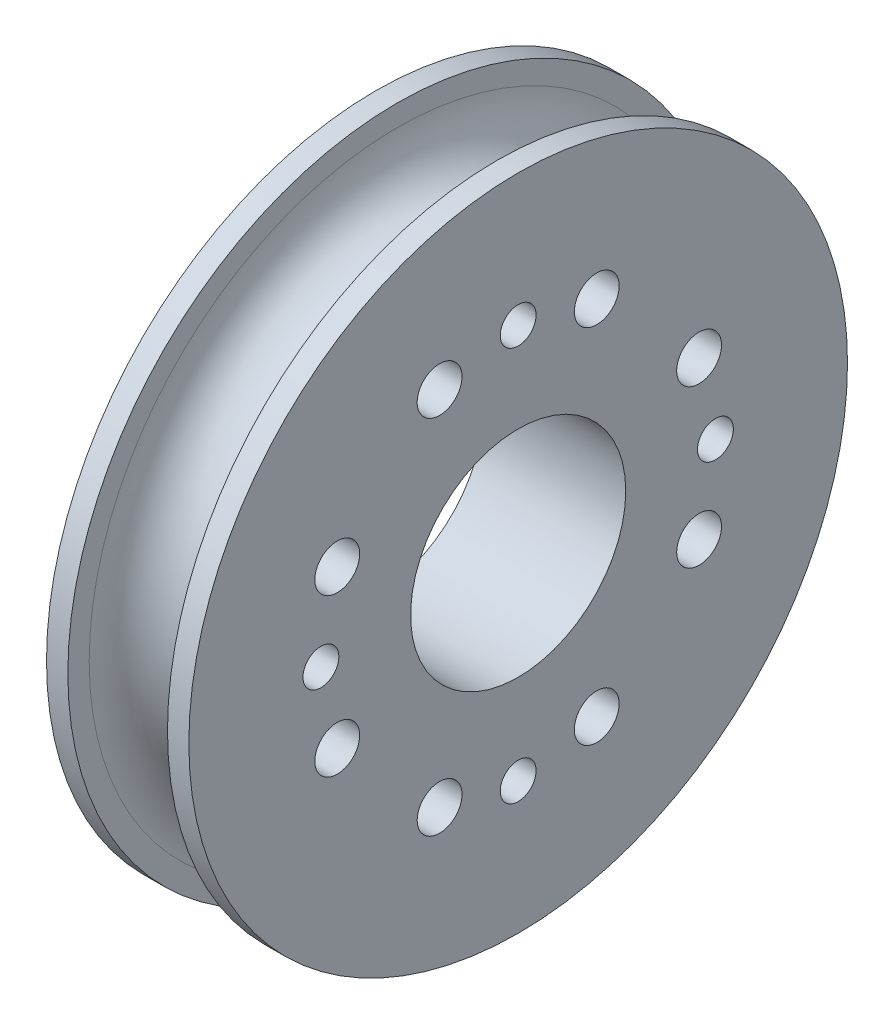
ISO-10303-21;
HEADER;
FILE_DESCRIPTION(('STEP AP214'),'2;1');
FILE_NAME('part.step','',(''),(''),'','','');
FILE_SCHEMA(('AUTOMOTIVE_DESIGN { 1 0 10303 214 1 1 1 1 }'));
ENDSEC;
DATA;
#1=APPLICATION_CONTEXT('core data for automotive mechanical design processes');
#2=APPLICATION_PROTOCOL_DEFINITION('international standard','automotive_design',2000,#1);
#3=PRODUCT_CONTEXT('',#1,'mechanical');
#4=PRODUCT('Part','Part','',(#3));
#5=PRODUCT_RELATED_PRODUCT_CATEGORY('part','',(#4));
#6=PRODUCT_DEFINITION_FORMATION('','',#4);
#7=PRODUCT_DEFINITION_CONTEXT('part definition',#1,'design');
#8=PRODUCT_DEFINITION('design','',#6,#7);
#9=PRODUCT_DEFINITION_SHAPE('','',#8);
#10=(LENGTH_UNIT() NAMED_UNIT(*) SI_UNIT(.MILLI.,.METRE.));
#11=(NAMED_UNIT(*) PLANE_ANGLE_UNIT() SI_UNIT($,.RADIAN.));
#12=(NAMED_UNIT(*) SI_UNIT($,.STERADIAN.) SOLID_ANGLE_UNIT());
#13=UNCERTAINTY_MEASURE_WITH_UNIT(LENGTH_MEASURE(1.E-05),#10,'distance_accuracy_value','');
#14=(GEOMETRIC_REPRESENTATION_CONTEXT(3) GLOBAL_UNCERTAINTY_ASSIGNED_CONTEXT((#13)) GLOBAL_UNIT_ASSIGNED_CONTEXT((#10,
#11,#12)) REPRESENTATION_CONTEXT('',''));
#15=CARTESIAN_POINT('',(0.,0.,0.));
#16=DIRECTION('',(0.,0.,1.));
#17=DIRECTION('',(1.,0.,0.));
#18=AXIS2_PLACEMENT_3D('',#15,#16,#17);
#19=CARTESIAN_POINT('',(7.9375,17.175,0.));
#20=DIRECTION('',(-1.,0.,0.));
#21=DIRECTION('',(0.,0.,1.));
#22=AXIS2_PLACEMENT_3D('',#19,#20,#21);
#23=PLANE('',#22);
#24=CARTESIAN_POINT('',(7.9375,4.38184149386817,10.0895720980929));
#25=DIRECTION('',(1.,0.,0.));
#26=DIRECTION('',(0.,0.,1.));
#27=AXIS2_PLACEMENT_3D('',#24,#25,#26);
#28=CIRCLE('',#27,1.25);
#29=CARTESIAN_POINT('',(7.9375,4.38184149386817,11.3395720980929));
#30=VERTEX_POINT('',#29);
#31=EDGE_CURVE('E129',#30,#30,#28,.T.);
#32=ORIENTED_EDGE('',*,*,#31,.F.);
#33=EDGE_LOOP('',(#32));
#34=FACE_BOUND('',#33,.T.);
#35=CARTESIAN_POINT('',(7.9375,-4.38184149386796,10.089572098093));
#36=DIRECTION('',(1.,0.,0.));
#37=DIRECTION('',(0.,0.,-1.));
#38=AXIS2_PLACEMENT_3D('',#35,#36,#37);
#39=CIRCLE('',#38,1.25);
#40=CARTESIAN_POINT('',(7.9375,-4.38184149386796,8.83957209809301));
#41=VERTEX_POINT('',#40);
#42=EDGE_CURVE('E123',#41,#41,#39,.T.);
#43=ORIENTED_EDGE('',*,*,#42,.F.);
#44=EDGE_LOOP('',(#43));
#45=FACE_BOUND('',#44,.T.);
#46=CARTESIAN_POINT('',(7.9375,1.1521895091661E-13,11.));
#47=DIRECTION('',(1.,0.,0.));
#48=DIRECTION('',(0.,0.,-1.));
#49=AXIS2_PLACEMENT_3D('',#46,#47,#48);
#50=CIRCLE('',#49,1.);
#51=CARTESIAN_POINT('',(7.9375,1.1521895091661E-13,10.));
#52=VERTEX_POINT('',#51);
#53=EDGE_CURVE('E117',#52,#52,#50,.T.);
#54=ORIENTED_EDGE('',*,*,#53,.F.);
#55=EDGE_LOOP('',(#54));
#56=FACE_BOUND('',#55,.T.);
#57=CARTESIAN_POINT('',(7.9375,-10.0895720980929,4.38184149386814));
#58=DIRECTION('',(1.,0.,0.));
#59=DIRECTION('',(0.,0.,1.));
#60=AXIS2_PLACEMENT_3D('',#57,#58,#59);
#61=CIRCLE('',#60,1.25);
#62=CARTESIAN_POINT('',(7.9375,-10.0895720980929,5.63184149386814));
#63=VERTEX_POINT('',#62);
#64=EDGE_CURVE('E111',#63,#63,#61,.T.);
#65=ORIENTED_EDGE('',*,*,#64,.F.);
#66=EDGE_LOOP('',(#65));
#67=FACE_BOUND('',#66,.T.);
#68=CARTESIAN_POINT('',(7.9375,-10.089572098093,-4.381841493868));
#69=DIRECTION('',(1.,0.,0.));
#70=DIRECTION('',(0.,0.,-1.));
#71=AXIS2_PLACEMENT_3D('',#68,#69,#70);
#72=CIRCLE('',#71,1.25);
#73=CARTESIAN_POINT('',(7.9375,-10.089572098093,-5.631841493868));
#74=VERTEX_POINT('',#73);
#75=EDGE_CURVE('E105',#74,#74,#72,.T.);
#76=ORIENTED_EDGE('',*,*,#75,.F.);
#77=EDGE_LOOP('',(#76));
#78=FACE_BOUND('',#77,.T.);
#79=CARTESIAN_POINT('',(7.9375,-11.,0.));
#80=DIRECTION('',(1.,0.,0.));
#81=DIRECTION('',(0.,0.,-1.));
#82=AXIS2_PLACEMENT_3D('',#79,#80,#81);
#83=CIRCLE('',#82,1.);
#84=CARTESIAN_POINT('',(7.9375,-11.,-0.999999999999924));
#85=VERTEX_POINT('',#84);
#86=EDGE_CURVE('E99',#85,#85,#83,.T.);
#87=ORIENTED_EDGE('',*,*,#86,.F.);
#88=EDGE_LOOP('',(#87));
#89=FACE_BOUND('',#88,.T.);
#90=CARTESIAN_POINT('',(7.9375,-4.3818414938681,-10.0895720980929));
#91=DIRECTION('',(1.,0.,0.));
#92=DIRECTION('',(0.,0.,1.));
#93=AXIS2_PLACEMENT_3D('',#90,#91,#92);
#94=CIRCLE('',#93,1.25);
#95=CARTESIAN_POINT('',(7.9375,-4.3818414938681,-8.83957209809292));
#96=VERTEX_POINT('',#95);
#97=EDGE_CURVE('E93',#96,#96,#94,.T.);
#98=ORIENTED_EDGE('',*,*,#97,.F.);
#99=EDGE_LOOP('',(#98));
#100=FACE_BOUND('',#99,.T.);
#101=CARTESIAN_POINT('',(7.9375,4.38184149386803,-10.089572098093));
#102=DIRECTION('',(1.,0.,0.));
#103=DIRECTION('',(0.,0.,-1.));
#104=AXIS2_PLACEMENT_3D('',#101,#102,#103);
#105=CIRCLE('',#104,1.25);
#106=CARTESIAN_POINT('',(7.9375,4.38184149386803,-11.339572098093));
#107=VERTEX_POINT('',#106);
#108=EDGE_CURVE('E87',#107,#107,#105,.T.);
#109=ORIENTED_EDGE('',*,*,#108,.F.);
#110=EDGE_LOOP('',(#109));
#111=FACE_BOUND('',#110,.T.);
#112=CARTESIAN_POINT('',(7.9375,0.,-11.));
#113=DIRECTION('',(1.,0.,0.));
#114=DIRECTION('',(0.,0.,-1.));
#115=AXIS2_PLACEMENT_3D('',#112,#113,#114);
#116=CIRCLE('',#115,1.);
#117=CARTESIAN_POINT('',(7.9375,0.,-12.));
#118=VERTEX_POINT('',#117);
#119=EDGE_CURVE('E81',#118,#118,#116,.T.);
#120=ORIENTED_EDGE('',*,*,#119,.F.);
#121=EDGE_LOOP('',(#120));
#122=FACE_BOUND('',#121,.T.);
#123=CARTESIAN_POINT('',(7.9375,10.0895720980929,-4.38184149386807));
#124=DIRECTION('',(1.,0.,0.));
#125=DIRECTION('',(0.,0.,1.));
#126=AXIS2_PLACEMENT_3D('',#123,#124,#125);
#127=CIRCLE('',#126,1.25);
#128=CARTESIAN_POINT('',(7.9375,10.0895720980929,-3.13184149386807));
#129=VERTEX_POINT('',#128);
#130=EDGE_CURVE('E75',#129,#129,#127,.T.);
#131=ORIENTED_EDGE('',*,*,#130,.F.);
#132=EDGE_LOOP('',(#131));
#133=FACE_BOUND('',#132,.T.);
#134=CARTESIAN_POINT('',(7.9375,10.089572098093,4.38184149386807));
#135=DIRECTION('',(1.,0.,0.));
#136=DIRECTION('',(0.,0.,-1.));
#137=AXIS2_PLACEMENT_3D('',#134,#135,#136);
#138=CIRCLE('',#137,1.25);
#139=CARTESIAN_POINT('',(7.9375,10.089572098093,3.13184149386807));
#140=VERTEX_POINT('',#139);
#141=EDGE_CURVE('E69',#140,#140,#138,.T.);
#142=ORIENTED_EDGE('',*,*,#141,.F.);
#143=EDGE_LOOP('',(#142));
#144=FACE_BOUND('',#143,.T.);
#145=CARTESIAN_POINT('',(7.9375,11.,0.));
#146=DIRECTION('',(1.,0.,0.));
#147=DIRECTION('',(0.,0.,-1.));
#148=AXIS2_PLACEMENT_3D('',#145,#146,#147);
#149=CIRCLE('',#148,1.);
#150=CARTESIAN_POINT('',(7.9375,11.,-1.));
#151=VERTEX_POINT('',#150);
#152=EDGE_CURVE('E63',#151,#151,#149,.T.);
#153=ORIENTED_EDGE('',*,*,#152,.F.);
#154=EDGE_LOOP('',(#153));
#155=FACE_BOUND('',#154,.T.);
#156=CARTESIAN_POINT('',(7.9375,0.,0.));
#157=DIRECTION('',(1.,0.,0.));
#158=DIRECTION('',(0.,0.,-1.));
#159=AXIS2_PLACEMENT_3D('',#156,#157,#158);
#160=CIRCLE('',#159,6.);
#161=CARTESIAN_POINT('',(7.9375,0.,-6.));
#162=VERTEX_POINT('',#161);
#163=EDGE_CURVE('E57',#162,#162,#160,.T.);
#164=ORIENTED_EDGE('',*,*,#163,.F.);
#165=EDGE_LOOP('',(#164));
#166=FACE_BOUND('',#165,.T.);
#167=CARTESIAN_POINT('',(7.9375,0.,0.));
#168=DIRECTION('',(-1.,0.,0.));
#169=DIRECTION('',(0.,0.,1.));
#170=AXIS2_PLACEMENT_3D('',#167,#168,#169);
#171=CIRCLE('',#170,18.365625);
#172=CARTESIAN_POINT('',(7.9375,0.,18.365625));
#173=VERTEX_POINT('',#172);
#174=EDGE_CURVE('E10',#173,#173,#171,.T.);
#175=ORIENTED_EDGE('',*,*,#174,.F.);
#176=EDGE_LOOP('',(#175));
#177=FACE_BOUND('',#176,.T.);
#178=ADVANCED_FACE('F31',(#34,#45,#56,#67,#78,#89,#100,#111,#122,#133,#144,#155,#166,#177),#23,.F.);
#179=CARTESIAN_POINT('',(0.,0.,0.));
#180=DIRECTION('',(-1.,0.,0.));
#181=DIRECTION('',(0.,0.,1.));
#182=AXIS2_PLACEMENT_3D('',#179,#180,#181);
#183=CYLINDRICAL_SURFACE('',#182,18.365625);
#184=CARTESIAN_POINT('',(6.746875,0.,0.));
#185=DIRECTION('',(-1.,0.,0.));
#186=DIRECTION('',(0.,0.,1.));
#187=AXIS2_PLACEMENT_3D('',#184,#185,#186);
#188=CIRCLE('',#187,18.365625);
#189=CARTESIAN_POINT('',(6.746875,0.,18.365625));
#190=VERTEX_POINT('',#189);
#191=EDGE_CURVE('E37',#190,#190,#188,.T.);
#192=ORIENTED_EDGE('',*,*,#191,.F.);
#193=EDGE_LOOP('',(#192));
#194=FACE_BOUND('',#193,.T.);
#195=ORIENTED_EDGE('',*,*,#174,.T.);
#196=EDGE_LOOP('',(#195));
#197=FACE_BOUND('',#196,.T.);
#198=ADVANCED_FACE('F147',(#194,#197),#183,.T.);
#199=CARTESIAN_POINT('',(6.746875,17.175,0.));
#200=DIRECTION('',(1.,0.,0.));
#201=DIRECTION('',(0.,0.,-1.));
#202=AXIS2_PLACEMENT_3D('',#199,#200,#201);
#203=PLANE('',#202);
#204=CARTESIAN_POINT('',(6.746875,0.,0.));
#205=DIRECTION('',(-1.,0.,0.));
#206=DIRECTION('',(0.,0.,1.));
#207=AXIS2_PLACEMENT_3D('',#204,#205,#206);
#208=CIRCLE('',#207,17.175);
#209=CARTESIAN_POINT('',(6.746875,0.,17.175));
#210=VERTEX_POINT('',#209);
#211=EDGE_CURVE('E41',#210,#210,#208,.T.);
#212=ORIENTED_EDGE('',*,*,#211,.F.);
#213=EDGE_LOOP('',(#212));
#214=FACE_BOUND('',#213,.T.);
#215=ORIENTED_EDGE('',*,*,#191,.T.);
#216=EDGE_LOOP('',(#215));
#217=FACE_BOUND('',#216,.T.);
#218=ADVANCED_FACE('F200',(#214,#217),#203,.F.);
#219=CARTESIAN_POINT('',(3.96875,0.,0.));
#220=DIRECTION('',(-1.,0.,0.));
#221=DIRECTION('',(0.,0.,1.));
#222=AXIS2_PLACEMENT_3D('',#219,#220,#221);
#223=TOROIDAL_SURFACE('',#222,17.175,2.778125);
#224=CARTESIAN_POINT('',(1.190625,0.,0.));
#225=DIRECTION('',(-1.,0.,0.));
#226=DIRECTION('',(0.,0.,1.));
#227=AXIS2_PLACEMENT_3D('',#224,#225,#226);
#228=CIRCLE('',#227,17.175);
#229=CARTESIAN_POINT('',(1.190625,0.,17.175));
#230=VERTEX_POINT('',#229);
#231=EDGE_CURVE('E45',#230,#230,#228,.T.);
#232=ORIENTED_EDGE('',*,*,#231,.F.);
#233=EDGE_LOOP('',(#232));
#234=FACE_BOUND('',#233,.T.);
#235=ORIENTED_EDGE('',*,*,#211,.T.);
#236=EDGE_LOOP('',(#235));
#237=FACE_BOUND('',#236,.T.);
#238=ADVANCED_FACE('F196',(#234,#237),#223,.F.);
#239=CARTESIAN_POINT('',(1.190625,17.175,0.));
#240=DIRECTION('',(-1.,0.,0.));
#241=DIRECTION('',(0.,0.,1.));
#242=AXIS2_PLACEMENT_3D('',#239,#240,#241);
#243=PLANE('',#242);
#244=CARTESIAN_POINT('',(1.190625,0.,0.));
#245=DIRECTION('',(-1.,0.,0.));
#246=DIRECTION('',(0.,0.,1.));
#247=AXIS2_PLACEMENT_3D('',#244,#245,#246);
#248=CIRCLE('',#247,18.365625);
#249=CARTESIAN_POINT('',(1.190625,0.,18.365625));
#250=VERTEX_POINT('',#249);
#251=EDGE_CURVE('E50',#250,#250,#248,.T.);
#252=ORIENTED_EDGE('',*,*,#251,.F.);
#253=EDGE_LOOP('',(#252));
#254=FACE_BOUND('',#253,.T.);
#255=ORIENTED_EDGE('',*,*,#231,.T.);
#256=EDGE_LOOP('',(#255));
#257=FACE_BOUND('',#256,.T.);
#258=ADVANCED_FACE('F192',(#254,#257),#243,.F.);
#259=CARTESIAN_POINT('',(0.,0.,0.));
#260=DIRECTION('',(-1.,0.,0.));
#261=DIRECTION('',(0.,0.,1.));
#262=AXIS2_PLACEMENT_3D('',#259,#260,#261);
#263=CYLINDRICAL_SURFACE('',#262,18.365625);
#264=CARTESIAN_POINT('',(0.,0.,0.));
#265=DIRECTION('',(-1.,0.,0.));
#266=DIRECTION('',(0.,0.,1.));
#267=AXIS2_PLACEMENT_3D('',#264,#265,#266);
#268=CIRCLE('',#267,18.365625);
#269=CARTESIAN_POINT('',(0.,0.,18.365625));
#270=VERTEX_POINT('',#269);
#271=EDGE_CURVE('E53',#270,#270,#268,.T.);
#272=ORIENTED_EDGE('',*,*,#271,.F.);
#273=EDGE_LOOP('',(#272));
#274=FACE_BOUND('',#273,.T.);
#275=ORIENTED_EDGE('',*,*,#251,.T.);
#276=EDGE_LOOP('',(#275));
#277=FACE_BOUND('',#276,.T.);
#278=ADVANCED_FACE('F185',(#274,#277),#263,.T.);
#279=CARTESIAN_POINT('',(0.,17.175,0.));
#280=DIRECTION('',(1.,0.,0.));
#281=DIRECTION('',(0.,0.,-1.));
#282=AXIS2_PLACEMENT_3D('',#279,#280,#281);
#283=PLANE('',#282);
#284=CARTESIAN_POINT('',(0.,4.38184149386817,10.0895720980929));
#285=DIRECTION('',(1.,0.,0.));
#286=DIRECTION('',(0.,0.,1.));
#287=AXIS2_PLACEMENT_3D('',#284,#285,#286);
#288=CIRCLE('',#287,1.25);
#289=CARTESIAN_POINT('',(0.,4.38184149386817,11.3395720980929));
#290=VERTEX_POINT('',#289);
#291=EDGE_CURVE('E126',#290,#290,#288,.T.);
#292=ORIENTED_EDGE('',*,*,#291,.T.);
#293=EDGE_LOOP('',(#292));
#294=FACE_BOUND('',#293,.T.);
#295=CARTESIAN_POINT('',(0.,-4.38184149386796,10.089572098093));
#296=DIRECTION('',(1.,0.,0.));
#297=DIRECTION('',(0.,0.,-1.));
#298=AXIS2_PLACEMENT_3D('',#295,#296,#297);
#299=CIRCLE('',#298,1.25);
#300=CARTESIAN_POINT('',(0.,-4.38184149386796,8.83957209809301));
#301=VERTEX_POINT('',#300);
#302=EDGE_CURVE('E120',#301,#301,#299,.T.);
#303=ORIENTED_EDGE('',*,*,#302,.T.);
#304=EDGE_LOOP('',(#303));
#305=FACE_BOUND('',#304,.T.);
#306=CARTESIAN_POINT('',(0.,1.1521895091661E-13,11.));
#307=DIRECTION('',(1.,0.,0.));
#308=DIRECTION('',(0.,0.,-1.));
#309=AXIS2_PLACEMENT_3D('',#306,#307,#308);
#310=CIRCLE('',#309,1.);
#311=CARTESIAN_POINT('',(0.,1.1521895091661E-13,10.));
#312=VERTEX_POINT('',#311);
#313=EDGE_CURVE('E114',#312,#312,#310,.T.);
#314=ORIENTED_EDGE('',*,*,#313,.T.);
#315=EDGE_LOOP('',(#314));
#316=FACE_BOUND('',#315,.T.);
#317=CARTESIAN_POINT('',(0.,-10.0895720980929,4.38184149386814));
#318=DIRECTION('',(1.,0.,0.));
#319=DIRECTION('',(0.,0.,1.));
#320=AXIS2_PLACEMENT_3D('',#317,#318,#319);
#321=CIRCLE('',#320,1.25);
#322=CARTESIAN_POINT('',(0.,-10.0895720980929,5.63184149386814));
#323=VERTEX_POINT('',#322);
#324=EDGE_CURVE('E108',#323,#323,#321,.T.);
#325=ORIENTED_EDGE('',*,*,#324,.T.);
#326=EDGE_LOOP('',(#325));
#327=FACE_BOUND('',#326,.T.);
#328=CARTESIAN_POINT('',(0.,-10.089572098093,-4.381841493868));
#329=DIRECTION('',(1.,0.,0.));
#330=DIRECTION('',(0.,0.,-1.));
#331=AXIS2_PLACEMENT_3D('',#328,#329,#330);
#332=CIRCLE('',#331,1.25);
#333=CARTESIAN_POINT('',(0.,-10.089572098093,-5.631841493868));
#334=VERTEX_POINT('',#333);
#335=EDGE_CURVE('E102',#334,#334,#332,.T.);
#336=ORIENTED_EDGE('',*,*,#335,.T.);
#337=EDGE_LOOP('',(#336));
#338=FACE_BOUND('',#337,.T.);
#339=CARTESIAN_POINT('',(0.,-11.,0.));
#340=DIRECTION('',(1.,0.,0.));
#341=DIRECTION('',(0.,0.,-1.));
#342=AXIS2_PLACEMENT_3D('',#339,#340,#341);
#343=CIRCLE('',#342,1.);
#344=CARTESIAN_POINT('',(0.,-11.,-0.999999999999924));
#345=VERTEX_POINT('',#344);
#346=EDGE_CURVE('E96',#345,#345,#343,.T.);
#347=ORIENTED_EDGE('',*,*,#346,.T.);
#348=EDGE_LOOP('',(#347));
#349=FACE_BOUND('',#348,.T.);
#350=CARTESIAN_POINT('',(0.,-4.3818414938681,-10.0895720980929));
#351=DIRECTION('',(1.,0.,0.));
#352=DIRECTION('',(0.,0.,1.));
#353=AXIS2_PLACEMENT_3D('',#350,#351,#352);
#354=CIRCLE('',#353,1.25);
#355=CARTESIAN_POINT('',(0.,-4.3818414938681,-8.83957209809292));
#356=VERTEX_POINT('',#355);
#357=EDGE_CURVE('E90',#356,#356,#354,.T.);
#358=ORIENTED_EDGE('',*,*,#357,.T.);
#359=EDGE_LOOP('',(#358));
#360=FACE_BOUND('',#359,.T.);
#361=CARTESIAN_POINT('',(0.,4.38184149386803,-10.089572098093));
#362=DIRECTION('',(1.,0.,0.));
#363=DIRECTION('',(0.,0.,-1.));
#364=AXIS2_PLACEMENT_3D('',#361,#362,#363);
#365=CIRCLE('',#364,1.25);
#366=CARTESIAN_POINT('',(0.,4.38184149386803,-11.339572098093));
#367=VERTEX_POINT('',#366);
#368=EDGE_CURVE('E84',#367,#367,#365,.T.);
#369=ORIENTED_EDGE('',*,*,#368,.T.);
#370=EDGE_LOOP('',(#369));
#371=FACE_BOUND('',#370,.T.);
#372=CARTESIAN_POINT('',(0.,0.,-11.));
#373=DIRECTION('',(1.,0.,0.));
#374=DIRECTION('',(0.,0.,-1.));
#375=AXIS2_PLACEMENT_3D('',#372,#373,#374);
#376=CIRCLE('',#375,1.);
#377=CARTESIAN_POINT('',(0.,0.,-12.));
#378=VERTEX_POINT('',#377);
#379=EDGE_CURVE('E78',#378,#378,#376,.T.);
#380=ORIENTED_EDGE('',*,*,#379,.T.);
#381=EDGE_LOOP('',(#380));
#382=FACE_BOUND('',#381,.T.);
#383=CARTESIAN_POINT('',(0.,10.0895720980929,-4.38184149386807));
#384=DIRECTION('',(1.,0.,0.));
#385=DIRECTION('',(0.,0.,1.));
#386=AXIS2_PLACEMENT_3D('',#383,#384,#385);
#387=CIRCLE('',#386,1.25);
#388=CARTESIAN_POINT('',(0.,10.0895720980929,-3.13184149386807));
#389=VERTEX_POINT('',#388);
#390=EDGE_CURVE('E72',#389,#389,#387,.T.);
#391=ORIENTED_EDGE('',*,*,#390,.T.);
#392=EDGE_LOOP('',(#391));
#393=FACE_BOUND('',#392,.T.);
#394=CARTESIAN_POINT('',(0.,10.089572098093,4.38184149386807));
#395=DIRECTION('',(1.,0.,0.));
#396=DIRECTION('',(0.,0.,-1.));
#397=AXIS2_PLACEMENT_3D('',#394,#395,#396);
#398=CIRCLE('',#397,1.25);
#399=CARTESIAN_POINT('',(0.,10.089572098093,3.13184149386807));
#400=VERTEX_POINT('',#399);
#401=EDGE_CURVE('E66',#400,#400,#398,.T.);
#402=ORIENTED_EDGE('',*,*,#401,.T.);
#403=EDGE_LOOP('',(#402));
#404=FACE_BOUND('',#403,.T.);
#405=CARTESIAN_POINT('',(0.,11.,0.));
#406=DIRECTION('',(1.,0.,0.));
#407=DIRECTION('',(0.,0.,-1.));
#408=AXIS2_PLACEMENT_3D('',#405,#406,#407);
#409=CIRCLE('',#408,1.);
#410=CARTESIAN_POINT('',(0.,11.,-1.));
#411=VERTEX_POINT('',#410);
#412=EDGE_CURVE('E60',#411,#411,#409,.T.);
#413=ORIENTED_EDGE('',*,*,#412,.T.);
#414=EDGE_LOOP('',(#413));
#415=FACE_BOUND('',#414,.T.);
#416=CARTESIAN_POINT('',(0.,0.,0.));
#417=DIRECTION('',(1.,0.,0.));
#418=DIRECTION('',(0.,0.,-1.));
#419=AXIS2_PLACEMENT_3D('',#416,#417,#418);
#420=CIRCLE('',#419,6.);
#421=CARTESIAN_POINT('',(0.,0.,-6.));
#422=VERTEX_POINT('',#421);
#423=EDGE_CURVE('E56',#422,#422,#420,.T.);
#424=ORIENTED_EDGE('',*,*,#423,.T.);
#425=EDGE_LOOP('',(#424));
#426=FACE_BOUND('',#425,.T.);
#427=ORIENTED_EDGE('',*,*,#271,.T.);
#428=EDGE_LOOP('',(#427));
#429=FACE_BOUND('',#428,.T.);
#430=ADVANCED_FACE('F135',(#294,#305,#316,#327,#338,#349,#360,#371,#382,#393,#404,#415,#426,
#429),#283,.F.);
#431=CARTESIAN_POINT('',(0.,0.,0.));
#432=DIRECTION('',(1.,0.,0.));
#433=DIRECTION('',(0.,0.,-1.));
#434=AXIS2_PLACEMENT_3D('',#431,#432,#433);
#435=CYLINDRICAL_SURFACE('',#434,6.);
#436=ORIENTED_EDGE('',*,*,#423,.F.);
#437=EDGE_LOOP('',(#436));
#438=FACE_BOUND('',#437,.T.);
#439=ORIENTED_EDGE('',*,*,#163,.T.);
#440=EDGE_LOOP('',(#439));
#441=FACE_BOUND('',#440,.T.);
#442=ADVANCED_FACE('F173',(#438,#441),#435,.F.);
#443=CARTESIAN_POINT('',(0.,11.,0.));
#444=DIRECTION('',(1.,0.,0.));
#445=DIRECTION('',(0.,0.,-1.));
#446=AXIS2_PLACEMENT_3D('',#443,#444,#445);
#447=CYLINDRICAL_SURFACE('',#446,1.);
#448=ORIENTED_EDGE('',*,*,#412,.F.);
#449=EDGE_LOOP('',(#448));
#450=FACE_BOUND('',#449,.T.);
#451=ORIENTED_EDGE('',*,*,#152,.T.);
#452=EDGE_LOOP('',(#451));
#453=FACE_BOUND('',#452,.T.);
#454=ADVANCED_FACE('F175',(#450,#453),#447,.F.);
#455=CARTESIAN_POINT('',(0.,10.089572098093,4.38184149386807));
#456=DIRECTION('',(1.,0.,0.));
#457=DIRECTION('',(0.,0.,-1.));
#458=AXIS2_PLACEMENT_3D('',#455,#456,#457);
#459=CYLINDRICAL_SURFACE('',#458,1.25);
#460=ORIENTED_EDGE('',*,*,#401,.F.);
#461=EDGE_LOOP('',(#460));
#462=FACE_BOUND('',#461,.T.);
#463=ORIENTED_EDGE('',*,*,#141,.T.);
#464=EDGE_LOOP('',(#463));
#465=FACE_BOUND('',#464,.T.);
#466=ADVANCED_FACE('F182',(#462,#465),#459,.F.);
#467=CARTESIAN_POINT('',(0.,10.0895720980929,-4.38184149386807));
#468=DIRECTION('',(1.,0.,0.));
#469=DIRECTION('',(0.,0.,-1.));
#470=AXIS2_PLACEMENT_3D('',#467,#468,#469);
#471=CYLINDRICAL_SURFACE('',#470,1.25);
#472=ORIENTED_EDGE('',*,*,#390,.F.);
#473=EDGE_LOOP('',(#472));
#474=FACE_BOUND('',#473,.T.);
#475=ORIENTED_EDGE('',*,*,#130,.T.);
#476=EDGE_LOOP('',(#475));
#477=FACE_BOUND('',#476,.T.);
#478=ADVANCED_FACE('F249',(#474,#477),#471,.F.);
#479=CARTESIAN_POINT('',(0.,0.,-11.));
#480=DIRECTION('',(1.,0.,0.));
#481=DIRECTION('',(0.,0.,-1.));
#482=AXIS2_PLACEMENT_3D('',#479,#480,#481);
#483=CYLINDRICAL_SURFACE('',#482,1.);
#484=ORIENTED_EDGE('',*,*,#379,.F.);
#485=EDGE_LOOP('',(#484));
#486=FACE_BOUND('',#485,.T.);
#487=ORIENTED_EDGE('',*,*,#119,.T.);
#488=EDGE_LOOP('',(#487));
#489=FACE_BOUND('',#488,.T.);
#490=ADVANCED_FACE('F258',(#486,#489),#483,.F.);
#491=CARTESIAN_POINT('',(0.,4.38184149386803,-10.089572098093));
#492=DIRECTION('',(1.,0.,0.));
#493=DIRECTION('',(0.,0.,-1.));
#494=AXIS2_PLACEMENT_3D('',#491,#492,#493);
#495=CYLINDRICAL_SURFACE('',#494,1.25);
#496=ORIENTED_EDGE('',*,*,#368,.F.);
#497=EDGE_LOOP('',(#496));
#498=FACE_BOUND('',#497,.T.);
#499=ORIENTED_EDGE('',*,*,#108,.T.);
#500=EDGE_LOOP('',(#499));
#501=FACE_BOUND('',#500,.T.);
#502=ADVANCED_FACE('F268',(#498,#501),#495,.F.);
#503=CARTESIAN_POINT('',(0.,-4.3818414938681,-10.0895720980929));
#504=DIRECTION('',(1.,0.,0.));
#505=DIRECTION('',(0.,0.,-1.));
#506=AXIS2_PLACEMENT_3D('',#503,#504,#505);
#507=CYLINDRICAL_SURFACE('',#506,1.25);
#508=ORIENTED_EDGE('',*,*,#357,.F.);
#509=EDGE_LOOP('',(#508));
#510=FACE_BOUND('',#509,.T.);
#511=ORIENTED_EDGE('',*,*,#97,.T.);
#512=EDGE_LOOP('',(#511));
#513=FACE_BOUND('',#512,.T.);
#514=ADVANCED_FACE('F278',(#510,#513),#507,.F.);
#515=CARTESIAN_POINT('',(0.,-11.,0.));
#516=DIRECTION('',(1.,0.,0.));
#517=DIRECTION('',(0.,0.,-1.));
#518=AXIS2_PLACEMENT_3D('',#515,#516,#517);
#519=CYLINDRICAL_SURFACE('',#518,1.);
#520=ORIENTED_EDGE('',*,*,#346,.F.);
#521=EDGE_LOOP('',(#520));
#522=FACE_BOUND('',#521,.T.);
#523=ORIENTED_EDGE('',*,*,#86,.T.);
#524=EDGE_LOOP('',(#523));
#525=FACE_BOUND('',#524,.T.);
#526=ADVANCED_FACE('F288',(#522,#525),#519,.F.);
#527=CARTESIAN_POINT('',(0.,-10.089572098093,-4.381841493868));
#528=DIRECTION('',(1.,0.,0.));
#529=DIRECTION('',(0.,0.,-1.));
#530=AXIS2_PLACEMENT_3D('',#527,#528,#529);
#531=CYLINDRICAL_SURFACE('',#530,1.25);
#532=ORIENTED_EDGE('',*,*,#335,.F.);
#533=EDGE_LOOP('',(#532));
#534=FACE_BOUND('',#533,.T.);
#535=ORIENTED_EDGE('',*,*,#75,.T.);
#536=EDGE_LOOP('',(#535));
#537=FACE_BOUND('',#536,.T.);
#538=ADVANCED_FACE('F298',(#534,#537),#531,.F.);
#539=CARTESIAN_POINT('',(0.,-10.0895720980929,4.38184149386814));
#540=DIRECTION('',(1.,0.,0.));
#541=DIRECTION('',(0.,0.,-1.));
#542=AXIS2_PLACEMENT_3D('',#539,#540,#541);
#543=CYLINDRICAL_SURFACE('',#542,1.25);
#544=ORIENTED_EDGE('',*,*,#324,.F.);
#545=EDGE_LOOP('',(#544));
#546=FACE_BOUND('',#545,.T.);
#547=ORIENTED_EDGE('',*,*,#64,.T.);
#548=EDGE_LOOP('',(#547));
#549=FACE_BOUND('',#548,.T.);
#550=ADVANCED_FACE('F308',(#546,#549),#543,.F.);
#551=CARTESIAN_POINT('',(0.,1.1521895091661E-13,11.));
#552=DIRECTION('',(1.,0.,0.));
#553=DIRECTION('',(0.,0.,-1.));
#554=AXIS2_PLACEMENT_3D('',#551,#552,#553);
#555=CYLINDRICAL_SURFACE('',#554,1.);
#556=ORIENTED_EDGE('',*,*,#313,.F.);
#557=EDGE_LOOP('',(#556));
#558=FACE_BOUND('',#557,.T.);
#559=ORIENTED_EDGE('',*,*,#53,.T.);
#560=EDGE_LOOP('',(#559));
#561=FACE_BOUND('',#560,.T.);
#562=ADVANCED_FACE('F318',(#558,#561),#555,.F.);
#563=CARTESIAN_POINT('',(0.,-4.38184149386796,10.089572098093));
#564=DIRECTION('',(1.,0.,0.));
#565=DIRECTION('',(0.,0.,-1.));
#566=AXIS2_PLACEMENT_3D('',#563,#564,#565);
#567=CYLINDRICAL_SURFACE('',#566,1.25);
#568=ORIENTED_EDGE('',*,*,#302,.F.);
#569=EDGE_LOOP('',(#568));
#570=FACE_BOUND('',#569,.T.);
#571=ORIENTED_EDGE('',*,*,#42,.T.);
#572=EDGE_LOOP('',(#571));
#573=FACE_BOUND('',#572,.T.);
#574=ADVANCED_FACE('F141',(#570,#573),#567,.F.);
#575=CARTESIAN_POINT('',(0.,4.38184149386817,10.0895720980929));
#576=DIRECTION('',(1.,0.,0.));
#577=DIRECTION('',(0.,0.,-1.));
#578=AXIS2_PLACEMENT_3D('',#575,#576,#577);
#579=CYLINDRICAL_SURFACE('',#578,1.25);
#580=ORIENTED_EDGE('',*,*,#291,.F.);
#581=EDGE_LOOP('',(#580));
#582=FACE_BOUND('',#581,.T.);
#583=ORIENTED_EDGE('',*,*,#31,.T.);
#584=EDGE_LOOP('',(#583));
#585=FACE_BOUND('',#584,.T.);
#586=ADVANCED_FACE('F138',(#582,#585),#579,.F.);
#587=CLOSED_SHELL('',(#178,#198,#218,#238,#258,#278,#430,#442,#454,#466,#478,#490,#502,#514,
#526,#538,#550,#562,#574,#586));
#588=MANIFOLD_SOLID_BREP('B2',#587);
#589=ADVANCED_BREP_SHAPE_REPRESENTATION('',(#18,#588),#14);
#590=SHAPE_DEFINITION_REPRESENTATION(#9,#589);
ENDSEC;
END-ISO-10303-21;
